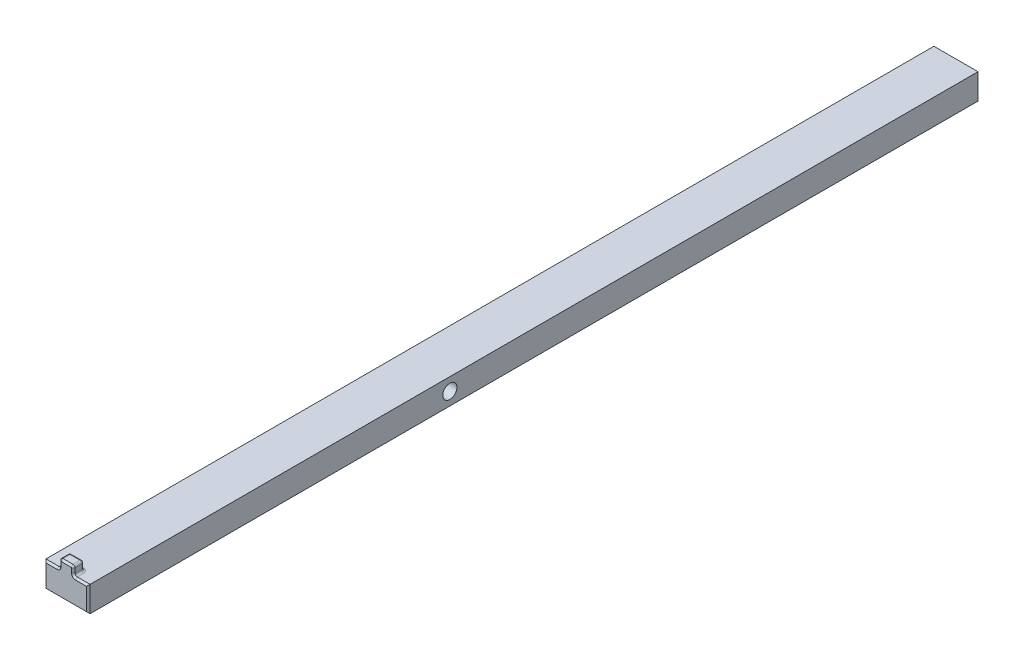
ISO-10303-21;
HEADER;
FILE_DESCRIPTION(('STEP AP214'),'2;1');
FILE_NAME('part.step','',(''),(''),'','','');
FILE_SCHEMA(('AUTOMOTIVE_DESIGN { 1 0 10303 214 1 1 1 1 }'));
ENDSEC;
DATA;
#1=APPLICATION_CONTEXT('core data for automotive mechanical design processes');
#2=APPLICATION_PROTOCOL_DEFINITION('international standard','automotive_design',2000,#1);
#3=PRODUCT_CONTEXT('',#1,'mechanical');
#4=PRODUCT('Part','Part','',(#3));
#5=PRODUCT_RELATED_PRODUCT_CATEGORY('part','',(#4));
#6=PRODUCT_DEFINITION_FORMATION('','',#4);
#7=PRODUCT_DEFINITION_CONTEXT('part definition',#1,'design');
#8=PRODUCT_DEFINITION('design','',#6,#7);
#9=PRODUCT_DEFINITION_SHAPE('','',#8);
#10=(LENGTH_UNIT() NAMED_UNIT(*) SI_UNIT(.MILLI.,.METRE.));
#11=(NAMED_UNIT(*) PLANE_ANGLE_UNIT() SI_UNIT($,.RADIAN.));
#12=(NAMED_UNIT(*) SI_UNIT($,.STERADIAN.) SOLID_ANGLE_UNIT());
#13=UNCERTAINTY_MEASURE_WITH_UNIT(LENGTH_MEASURE(1.E-05),#10,'distance_accuracy_value','');
#14=(GEOMETRIC_REPRESENTATION_CONTEXT(3) GLOBAL_UNCERTAINTY_ASSIGNED_CONTEXT((#13)) GLOBAL_UNIT_ASSIGNED_CONTEXT((#10,
#11,#12)) REPRESENTATION_CONTEXT('',''));
#15=CARTESIAN_POINT('',(0.,0.,0.));
#16=DIRECTION('',(0.,0.,1.));
#17=DIRECTION('',(1.,0.,0.));
#18=AXIS2_PLACEMENT_3D('',#15,#16,#17);
#19=CARTESIAN_POINT('',(6.23,-31.784,-37.8));
#20=DIRECTION('',(0.,-1.,0.));
#21=DIRECTION('',(0.,0.,-1.));
#22=AXIS2_PLACEMENT_3D('',#19,#20,#21);
#23=PLANE('',#22);
#24=DIRECTION('',(0.,0.,1.));
#25=VECTOR('',#24,1.);
#26=CARTESIAN_POINT('',(6.23,-31.784,-37.8));
#27=LINE('',#26,#25);
#28=CARTESIAN_POINT('',(6.23,-31.784,-289.3));
#29=VERTEX_POINT('',#28);
#30=CARTESIAN_POINT('',(6.23,-31.784,-38.3));
#31=VERTEX_POINT('',#30);
#32=EDGE_CURVE('E214',#29,#31,#27,.T.);
#33=ORIENTED_EDGE('',*,*,#32,.F.);
#34=DIRECTION('',(-1.,0.,0.));
#35=VECTOR('',#34,1.);
#36=CARTESIAN_POINT('',(6.23,-31.784,-289.3));
#37=LINE('',#36,#35);
#38=CARTESIAN_POINT('',(-6.23,-31.784,-289.3));
#39=VERTEX_POINT('',#38);
#40=EDGE_CURVE('E307',#29,#39,#37,.T.);
#41=ORIENTED_EDGE('',*,*,#40,.T.);
#42=DIRECTION('',(0.,0.,1.));
#43=VECTOR('',#42,1.);
#44=CARTESIAN_POINT('',(-6.23,-31.784,-37.8));
#45=LINE('',#44,#43);
#46=CARTESIAN_POINT('',(-6.23,-31.784,-38.3));
#47=VERTEX_POINT('',#46);
#48=EDGE_CURVE('E476',#39,#47,#45,.T.);
#49=ORIENTED_EDGE('',*,*,#48,.T.);
#50=DIRECTION('',(1.,0.,0.));
#51=VECTOR('',#50,1.);
#52=CARTESIAN_POINT('',(6.23,-31.784,-38.3));
#53=LINE('',#52,#51);
#54=CARTESIAN_POINT('',(-2.6,-31.784,-38.3));
#55=VERTEX_POINT('',#54);
#56=EDGE_CURVE('E304',#47,#55,#53,.T.);
#57=ORIENTED_EDGE('',*,*,#56,.T.);
#58=DIRECTION('',(0.,0.,1.));
#59=VECTOR('',#58,1.);
#60=CARTESIAN_POINT('',(-2.6,-31.784,-37.8));
#61=LINE('',#60,#59);
#62=CARTESIAN_POINT('',(-2.6,-31.784,-40.2));
#63=VERTEX_POINT('',#62);
#64=EDGE_CURVE('E232',#55,#63,#61,.F.);
#65=ORIENTED_EDGE('',*,*,#64,.T.);
#66=CARTESIAN_POINT('',(-1.4,-31.784,-40.2));
#67=DIRECTION('',(0.,-1.,0.));
#68=DIRECTION('',(0.,0.,-1.));
#69=AXIS2_PLACEMENT_3D('',#66,#67,#68);
#70=CIRCLE('',#69,1.2);
#71=CARTESIAN_POINT('',(-1.4,-31.784,-41.4));
#72=VERTEX_POINT('',#71);
#73=EDGE_CURVE('E229',#72,#63,#70,.F.);
#74=ORIENTED_EDGE('',*,*,#73,.F.);
#75=DIRECTION('',(1.,0.,0.));
#76=VECTOR('',#75,1.);
#77=CARTESIAN_POINT('',(2.,-31.784,-41.4));
#78=LINE('',#77,#76);
#79=CARTESIAN_POINT('',(1.4,-31.784,-41.4));
#80=VERTEX_POINT('',#79);
#81=EDGE_CURVE('E224',#72,#80,#78,.T.);
#82=ORIENTED_EDGE('',*,*,#81,.T.);
#83=CARTESIAN_POINT('',(1.4,-31.784,-40.2));
#84=DIRECTION('',(0.,-1.,0.));
#85=DIRECTION('',(0.,0.,-1.));
#86=AXIS2_PLACEMENT_3D('',#83,#84,#85);
#87=CIRCLE('',#86,1.2);
#88=CARTESIAN_POINT('',(2.6,-31.784,-40.2));
#89=VERTEX_POINT('',#88);
#90=EDGE_CURVE('E221',#89,#80,#87,.F.);
#91=ORIENTED_EDGE('',*,*,#90,.F.);
#92=DIRECTION('',(0.,0.,1.));
#93=VECTOR('',#92,1.);
#94=CARTESIAN_POINT('',(2.6,-31.784,-37.8));
#95=LINE('',#94,#93);
#96=CARTESIAN_POINT('',(2.6,-31.784,-38.3));
#97=VERTEX_POINT('',#96);
#98=EDGE_CURVE('E226',#89,#97,#95,.T.);
#99=ORIENTED_EDGE('',*,*,#98,.T.);
#100=DIRECTION('',(1.,0.,0.));
#101=VECTOR('',#100,1.);
#102=CARTESIAN_POINT('',(6.23,-31.784,-38.3));
#103=LINE('',#102,#101);
#104=EDGE_CURVE('E302',#97,#31,#103,.T.);
#105=ORIENTED_EDGE('',*,*,#104,.T.);
#106=EDGE_LOOP('',(#33,#41,#49,#57,#65,#74,#82,#91,#99,#105));
#107=FACE_BOUND('',#106,.T.);
#108=ADVANCED_FACE('F17',(#107),#23,.F.);
#109=CARTESIAN_POINT('',(6.23,0.,0.));
#110=DIRECTION('',(1.,0.,0.));
#111=DIRECTION('',(0.,0.,-1.));
#112=AXIS2_PLACEMENT_3D('',#109,#110,#111);
#113=PLANE('',#112);
#114=DIRECTION('',(0.,0.,-1.));
#115=VECTOR('',#114,1.);
#116=CARTESIAN_POINT('',(6.23,-38.984,-37.8));
#117=LINE('',#116,#115);
#118=CARTESIAN_POINT('',(6.23,-38.984,-38.3));
#119=VERTEX_POINT('',#118);
#120=CARTESIAN_POINT('',(6.23,-38.984,-289.3));
#121=VERTEX_POINT('',#120);
#122=EDGE_CURVE('E211',#119,#121,#117,.T.);
#123=ORIENTED_EDGE('',*,*,#122,.T.);
#124=DIRECTION('',(0.,1.,0.));
#125=VECTOR('',#124,1.);
#126=CARTESIAN_POINT('',(6.23,-31.784,-289.3));
#127=LINE('',#126,#125);
#128=EDGE_CURVE('E282',#121,#29,#127,.T.);
#129=ORIENTED_EDGE('',*,*,#128,.T.);
#130=ORIENTED_EDGE('',*,*,#32,.T.);
#131=DIRECTION('',(0.,-1.,0.));
#132=VECTOR('',#131,1.);
#133=CARTESIAN_POINT('',(6.23,-38.984,-38.3));
#134=LINE('',#133,#132);
#135=EDGE_CURVE('E254',#31,#119,#134,.T.);
#136=ORIENTED_EDGE('',*,*,#135,.T.);
#137=EDGE_LOOP('',(#123,#129,#130,#136));
#138=FACE_BOUND('',#137,.T.);
#139=CARTESIAN_POINT('',(6.23,-35.384,-140.));
#140=DIRECTION('',(1.,0.,0.));
#141=DIRECTION('',(0.,0.,-1.));
#142=AXIS2_PLACEMENT_3D('',#139,#140,#141);
#143=CIRCLE('',#142,2.);
#144=CARTESIAN_POINT('',(6.23,-35.384,-142.));
#145=VERTEX_POINT('',#144);
#146=EDGE_CURVE('E479',#145,#145,#143,.T.);
#147=ORIENTED_EDGE('',*,*,#146,.F.);
#148=EDGE_LOOP('',(#147));
#149=FACE_BOUND('',#148,.T.);
#150=ADVANCED_FACE('F455',(#138,#149),#113,.T.);
#151=CARTESIAN_POINT('',(-6.23,0.,0.));
#152=DIRECTION('',(1.,0.,0.));
#153=DIRECTION('',(0.,0.,-1.));
#154=AXIS2_PLACEMENT_3D('',#151,#152,#153);
#155=PLANE('',#154);
#156=ORIENTED_EDGE('',*,*,#48,.F.);
#157=DIRECTION('',(0.,-1.,0.));
#158=VECTOR('',#157,1.);
#159=CARTESIAN_POINT('',(-6.23,0.,-289.3));
#160=LINE('',#159,#158);
#161=CARTESIAN_POINT('',(-6.23,-38.984,-289.3));
#162=VERTEX_POINT('',#161);
#163=EDGE_CURVE('E300',#39,#162,#160,.T.);
#164=ORIENTED_EDGE('',*,*,#163,.T.);
#165=DIRECTION('',(0.,0.,-1.));
#166=VECTOR('',#165,1.);
#167=CARTESIAN_POINT('',(-6.23,-38.984,-37.8));
#168=LINE('',#167,#166);
#169=CARTESIAN_POINT('',(-6.23,-38.984,-38.3));
#170=VERTEX_POINT('',#169);
#171=EDGE_CURVE('E217',#170,#162,#168,.T.);
#172=ORIENTED_EDGE('',*,*,#171,.F.);
#173=DIRECTION('',(0.,1.,0.));
#174=VECTOR('',#173,1.);
#175=CARTESIAN_POINT('',(-6.23,0.,-38.3));
#176=LINE('',#175,#174);
#177=EDGE_CURVE('E298',#170,#47,#176,.T.);
#178=ORIENTED_EDGE('',*,*,#177,.T.);
#179=EDGE_LOOP('',(#156,#164,#172,#178));
#180=FACE_BOUND('',#179,.T.);
#181=CARTESIAN_POINT('',(-6.23,-35.384,-140.));
#182=DIRECTION('',(1.,0.,0.));
#183=DIRECTION('',(0.,0.,-1.));
#184=AXIS2_PLACEMENT_3D('',#181,#182,#183);
#185=CIRCLE('',#184,2.);
#186=CARTESIAN_POINT('',(-6.23,-35.384,-142.));
#187=VERTEX_POINT('',#186);
#188=EDGE_CURVE('E280',#187,#187,#185,.T.);
#189=ORIENTED_EDGE('',*,*,#188,.T.);
#190=EDGE_LOOP('',(#189));
#191=FACE_BOUND('',#190,.T.);
#192=ADVANCED_FACE('F487',(#180,#191),#155,.F.);
#193=CARTESIAN_POINT('',(6.23,-31.784,-289.8));
#194=DIRECTION('',(0.,0.,1.));
#195=DIRECTION('',(1.,0.,0.));
#196=AXIS2_PLACEMENT_3D('',#193,#194,#195);
#197=PLANE('',#196);
#198=DIRECTION('',(1.,0.,0.));
#199=VECTOR('',#198,1.);
#200=CARTESIAN_POINT('',(6.23,-32.284,-289.8));
#201=LINE('',#200,#199);
#202=CARTESIAN_POINT('',(-5.73,-32.284,-289.8));
#203=VERTEX_POINT('',#202);
#204=CARTESIAN_POINT('',(5.73,-32.284,-289.8));
#205=VERTEX_POINT('',#204);
#206=EDGE_CURVE('E285',#203,#205,#201,.T.);
#207=ORIENTED_EDGE('',*,*,#206,.T.);
#208=DIRECTION('',(0.,-1.,0.));
#209=VECTOR('',#208,1.);
#210=CARTESIAN_POINT('',(5.73,-38.984,-289.8));
#211=LINE('',#210,#209);
#212=CARTESIAN_POINT('',(5.73,-38.484,-289.8));
#213=VERTEX_POINT('',#212);
#214=EDGE_CURVE('E291',#205,#213,#211,.T.);
#215=ORIENTED_EDGE('',*,*,#214,.T.);
#216=DIRECTION('',(-1.,0.,0.));
#217=VECTOR('',#216,1.);
#218=CARTESIAN_POINT('',(6.23,-38.484,-289.8));
#219=LINE('',#218,#217);
#220=CARTESIAN_POINT('',(-5.73,-38.484,-289.8));
#221=VERTEX_POINT('',#220);
#222=EDGE_CURVE('E289',#213,#221,#219,.T.);
#223=ORIENTED_EDGE('',*,*,#222,.T.);
#224=DIRECTION('',(0.,1.,0.));
#225=VECTOR('',#224,1.);
#226=CARTESIAN_POINT('',(-5.73,-31.784,-289.8));
#227=LINE('',#226,#225);
#228=EDGE_CURVE('E287',#221,#203,#227,.T.);
#229=ORIENTED_EDGE('',*,*,#228,.T.);
#230=EDGE_LOOP('',(#207,#215,#223,#229));
#231=FACE_BOUND('',#230,.T.);
#232=ADVANCED_FACE('F507',(#231),#197,.F.);
#233=CARTESIAN_POINT('',(6.23,-31.784,-37.8));
#234=DIRECTION('',(0.,0.,-1.));
#235=DIRECTION('',(-1.,0.,0.));
#236=AXIS2_PLACEMENT_3D('',#233,#234,#235);
#237=PLANE('',#236);
#238=CARTESIAN_POINT('',(-2.6,-31.184,-37.8));
#239=DIRECTION('',(0.,0.,-1.));
#240=DIRECTION('',(-1.,0.,0.));
#241=AXIS2_PLACEMENT_3D('',#238,#239,#240);
#242=CIRCLE('',#241,1.1);
#243=CARTESIAN_POINT('',(-1.5,-31.184,-37.8));
#244=VERTEX_POINT('',#243);
#245=CARTESIAN_POINT('',(-2.6,-32.284,-37.8));
#246=VERTEX_POINT('',#245);
#247=EDGE_CURVE('E329',#244,#246,#242,.T.);
#248=ORIENTED_EDGE('',*,*,#247,.T.);
#249=DIRECTION('',(-1.,0.,0.));
#250=VECTOR('',#249,1.);
#251=CARTESIAN_POINT('',(6.23,-32.284,-37.8));
#252=LINE('',#251,#250);
#253=CARTESIAN_POINT('',(-5.73,-32.284,-37.8));
#254=VERTEX_POINT('',#253);
#255=EDGE_CURVE('E331',#246,#254,#252,.T.);
#256=ORIENTED_EDGE('',*,*,#255,.T.);
#257=DIRECTION('',(0.,-1.,0.));
#258=VECTOR('',#257,1.);
#259=CARTESIAN_POINT('',(-5.73,-31.784,-37.8));
#260=LINE('',#259,#258);
#261=CARTESIAN_POINT('',(-5.73,-38.484,-37.8));
#262=VERTEX_POINT('',#261);
#263=EDGE_CURVE('E313',#254,#262,#260,.T.);
#264=ORIENTED_EDGE('',*,*,#263,.T.);
#265=DIRECTION('',(1.,0.,0.));
#266=VECTOR('',#265,1.);
#267=CARTESIAN_POINT('',(6.23,-38.484,-37.8));
#268=LINE('',#267,#266);
#269=CARTESIAN_POINT('',(5.73,-38.484,-37.8));
#270=VERTEX_POINT('',#269);
#271=EDGE_CURVE('E311',#262,#270,#268,.T.);
#272=ORIENTED_EDGE('',*,*,#271,.T.);
#273=DIRECTION('',(0.,1.,0.));
#274=VECTOR('',#273,1.);
#275=CARTESIAN_POINT('',(5.73,-31.784,-37.8));
#276=LINE('',#275,#274);
#277=CARTESIAN_POINT('',(5.73,-32.284,-37.8));
#278=VERTEX_POINT('',#277);
#279=EDGE_CURVE('E309',#270,#278,#276,.T.);
#280=ORIENTED_EDGE('',*,*,#279,.T.);
#281=DIRECTION('',(-1.,0.,0.));
#282=VECTOR('',#281,1.);
#283=CARTESIAN_POINT('',(6.23,-32.284,-37.8));
#284=LINE('',#283,#282);
#285=CARTESIAN_POINT('',(2.6,-32.284,-37.8));
#286=VERTEX_POINT('',#285);
#287=EDGE_CURVE('E315',#278,#286,#284,.T.);
#288=ORIENTED_EDGE('',*,*,#287,.T.);
#289=CARTESIAN_POINT('',(2.6,-31.184,-37.8));
#290=DIRECTION('',(0.,0.,-1.));
#291=DIRECTION('',(-1.,0.,0.));
#292=AXIS2_PLACEMENT_3D('',#289,#290,#291);
#293=CIRCLE('',#292,1.1);
#294=CARTESIAN_POINT('',(1.5,-31.184,-37.8));
#295=VERTEX_POINT('',#294);
#296=EDGE_CURVE('E317',#286,#295,#293,.T.);
#297=ORIENTED_EDGE('',*,*,#296,.T.);
#298=DIRECTION('',(0.,1.,0.));
#299=VECTOR('',#298,1.);
#300=CARTESIAN_POINT('',(1.5,-29.884,-37.8));
#301=LINE('',#300,#299);
#302=CARTESIAN_POINT('',(1.5,-29.884,-37.8));
#303=VERTEX_POINT('',#302);
#304=EDGE_CURVE('E319',#295,#303,#301,.T.);
#305=ORIENTED_EDGE('',*,*,#304,.T.);
#306=CARTESIAN_POINT('',(1.4,-29.884,-37.8));
#307=DIRECTION('',(0.,0.,-1.));
#308=DIRECTION('',(-1.,0.,0.));
#309=AXIS2_PLACEMENT_3D('',#306,#307,#308);
#310=CIRCLE('',#309,0.1);
#311=CARTESIAN_POINT('',(1.4,-29.784,-37.8));
#312=VERTEX_POINT('',#311);
#313=EDGE_CURVE('E321',#303,#312,#310,.F.);
#314=ORIENTED_EDGE('',*,*,#313,.T.);
#315=DIRECTION('',(-1.,0.,0.));
#316=VECTOR('',#315,1.);
#317=CARTESIAN_POINT('',(-1.4,-29.784,-37.8));
#318=LINE('',#317,#316);
#319=CARTESIAN_POINT('',(-1.4,-29.784,-37.8));
#320=VERTEX_POINT('',#319);
#321=EDGE_CURVE('E323',#312,#320,#318,.T.);
#322=ORIENTED_EDGE('',*,*,#321,.T.);
#323=CARTESIAN_POINT('',(-1.4,-29.884,-37.8));
#324=DIRECTION('',(0.,0.,-1.));
#325=DIRECTION('',(-1.,0.,0.));
#326=AXIS2_PLACEMENT_3D('',#323,#324,#325);
#327=CIRCLE('',#326,0.1);
#328=CARTESIAN_POINT('',(-1.5,-29.884,-37.8));
#329=VERTEX_POINT('',#328);
#330=EDGE_CURVE('E325',#320,#329,#327,.F.);
#331=ORIENTED_EDGE('',*,*,#330,.T.);
#332=DIRECTION('',(0.,-1.,0.));
#333=VECTOR('',#332,1.);
#334=CARTESIAN_POINT('',(-1.5,-31.184,-37.8));
#335=LINE('',#334,#333);
#336=EDGE_CURVE('E327',#329,#244,#335,.T.);
#337=ORIENTED_EDGE('',*,*,#336,.T.);
#338=EDGE_LOOP('',(#248,#256,#264,#272,#280,#288,#297,#305,#314,#322,#331,#337));
#339=FACE_BOUND('',#338,.T.);
#340=ADVANCED_FACE('F441',(#339),#237,.F.);
#341=CARTESIAN_POINT('',(6.23,-38.984,-37.8));
#342=DIRECTION('',(0.,1.,0.));
#343=DIRECTION('',(0.,0.,1.));
#344=AXIS2_PLACEMENT_3D('',#341,#342,#343);
#345=PLANE('',#344);
#346=ORIENTED_EDGE('',*,*,#171,.T.);
#347=DIRECTION('',(1.,0.,0.));
#348=VECTOR('',#347,1.);
#349=CARTESIAN_POINT('',(6.23,-38.984,-289.3));
#350=LINE('',#349,#348);
#351=EDGE_CURVE('E296',#162,#121,#350,.T.);
#352=ORIENTED_EDGE('',*,*,#351,.T.);
#353=ORIENTED_EDGE('',*,*,#122,.F.);
#354=DIRECTION('',(-1.,0.,0.));
#355=VECTOR('',#354,1.);
#356=CARTESIAN_POINT('',(6.23,-38.984,-38.3));
#357=LINE('',#356,#355);
#358=EDGE_CURVE('E294',#119,#170,#357,.T.);
#359=ORIENTED_EDGE('',*,*,#358,.T.);
#360=EDGE_LOOP('',(#346,#352,#353,#359));
#361=FACE_BOUND('',#360,.T.);
#362=ADVANCED_FACE('F460',(#361),#345,.F.);
#363=CARTESIAN_POINT('',(6.23,-35.384,-140.));
#364=DIRECTION('',(-1.,0.,0.));
#365=DIRECTION('',(0.,0.,1.));
#366=AXIS2_PLACEMENT_3D('',#363,#364,#365);
#367=CYLINDRICAL_SURFACE('',#366,2.);
#368=ORIENTED_EDGE('',*,*,#146,.T.);
#369=EDGE_LOOP('',(#368));
#370=FACE_BOUND('',#369,.T.);
#371=ORIENTED_EDGE('',*,*,#188,.F.);
#372=EDGE_LOOP('',(#371));
#373=FACE_BOUND('',#372,.T.);
#374=ADVANCED_FACE('F489',(#370,#373),#367,.F.);
#375=CARTESIAN_POINT('',(-2.,-29.284,-40.8));
#376=DIRECTION('',(-1.,0.,0.));
#377=DIRECTION('',(0.,-1.,0.));
#378=AXIS2_PLACEMENT_3D('',#375,#376,#377);
#379=PLANE('',#378);
#380=DIRECTION('',(0.,0.,1.));
#381=VECTOR('',#380,1.);
#382=CARTESIAN_POINT('',(-2.,-31.184,-40.8));
#383=LINE('',#382,#381);
#384=CARTESIAN_POINT('',(-2.,-31.184,-40.2));
#385=VERTEX_POINT('',#384);
#386=CARTESIAN_POINT('',(-2.,-31.184,-38.3));
#387=VERTEX_POINT('',#386);
#388=EDGE_CURVE('E185',#385,#387,#383,.T.);
#389=ORIENTED_EDGE('',*,*,#388,.T.);
#390=DIRECTION('',(0.,1.,0.));
#391=VECTOR('',#390,1.);
#392=CARTESIAN_POINT('',(-2.,-29.884,-38.3));
#393=LINE('',#392,#391);
#394=CARTESIAN_POINT('',(-2.,-29.884,-38.3));
#395=VERTEX_POINT('',#394);
#396=EDGE_CURVE('E182',#387,#395,#393,.T.);
#397=ORIENTED_EDGE('',*,*,#396,.T.);
#398=DIRECTION('',(0.,0.,1.));
#399=VECTOR('',#398,1.);
#400=CARTESIAN_POINT('',(-2.,-29.884,-40.8));
#401=LINE('',#400,#399);
#402=CARTESIAN_POINT('',(-2.,-29.884,-40.2));
#403=VERTEX_POINT('',#402);
#404=EDGE_CURVE('E174',#395,#403,#401,.F.);
#405=ORIENTED_EDGE('',*,*,#404,.T.);
#406=DIRECTION('',(0.,-1.,0.));
#407=VECTOR('',#406,1.);
#408=CARTESIAN_POINT('',(-2.,-31.784,-40.2));
#409=LINE('',#408,#407);
#410=EDGE_CURVE('E179',#403,#385,#409,.T.);
#411=ORIENTED_EDGE('',*,*,#410,.T.);
#412=EDGE_LOOP('',(#389,#397,#405,#411));
#413=FACE_BOUND('',#412,.T.);
#414=ADVANCED_FACE('F177',(#413),#379,.T.);
#415=CARTESIAN_POINT('',(2.,-29.284,-40.8));
#416=DIRECTION('',(0.,1.,0.));
#417=DIRECTION('',(0.,0.,1.));
#418=AXIS2_PLACEMENT_3D('',#415,#416,#417);
#419=PLANE('',#418);
#420=DIRECTION('',(0.,0.,1.));
#421=VECTOR('',#420,1.);
#422=CARTESIAN_POINT('',(-1.4,-29.284,-40.8));
#423=LINE('',#422,#421);
#424=CARTESIAN_POINT('',(-1.4,-29.284,-40.2));
#425=VERTEX_POINT('',#424);
#426=CARTESIAN_POINT('',(-1.4,-29.284,-38.3));
#427=VERTEX_POINT('',#426);
#428=EDGE_CURVE('E193',#425,#427,#423,.T.);
#429=ORIENTED_EDGE('',*,*,#428,.T.);
#430=DIRECTION('',(1.,0.,0.));
#431=VECTOR('',#430,1.);
#432=CARTESIAN_POINT('',(1.4,-29.284,-38.3));
#433=LINE('',#432,#431);
#434=CARTESIAN_POINT('',(1.4,-29.284,-38.3));
#435=VERTEX_POINT('',#434);
#436=EDGE_CURVE('E339',#427,#435,#433,.T.);
#437=ORIENTED_EDGE('',*,*,#436,.T.);
#438=DIRECTION('',(0.,0.,1.));
#439=VECTOR('',#438,1.);
#440=CARTESIAN_POINT('',(1.4,-29.284,-40.8));
#441=LINE('',#440,#439);
#442=CARTESIAN_POINT('',(1.4,-29.284,-40.2));
#443=VERTEX_POINT('',#442);
#444=EDGE_CURVE('E242',#435,#443,#441,.F.);
#445=ORIENTED_EDGE('',*,*,#444,.T.);
#446=DIRECTION('',(-1.,0.,0.));
#447=VECTOR('',#446,1.);
#448=CARTESIAN_POINT('',(-2.,-29.284,-40.2));
#449=LINE('',#448,#447);
#450=EDGE_CURVE('E240',#443,#425,#449,.T.);
#451=ORIENTED_EDGE('',*,*,#450,.T.);
#452=EDGE_LOOP('',(#429,#437,#445,#451));
#453=FACE_BOUND('',#452,.T.);
#454=ADVANCED_FACE('F429',(#453),#419,.T.);
#455=CARTESIAN_POINT('',(2.,-31.784,-40.8));
#456=DIRECTION('',(1.,0.,0.));
#457=DIRECTION('',(0.,1.,0.));
#458=AXIS2_PLACEMENT_3D('',#455,#456,#457);
#459=PLANE('',#458);
#460=DIRECTION('',(0.,0.,1.));
#461=VECTOR('',#460,1.);
#462=CARTESIAN_POINT('',(2.,-29.884,-40.8));
#463=LINE('',#462,#461);
#464=CARTESIAN_POINT('',(2.,-29.884,-40.2));
#465=VERTEX_POINT('',#464);
#466=CARTESIAN_POINT('',(2.,-29.884,-38.3));
#467=VERTEX_POINT('',#466);
#468=EDGE_CURVE('E236',#465,#467,#463,.T.);
#469=ORIENTED_EDGE('',*,*,#468,.T.);
#470=DIRECTION('',(0.,-1.,0.));
#471=VECTOR('',#470,1.);
#472=CARTESIAN_POINT('',(2.,-31.184,-38.3));
#473=LINE('',#472,#471);
#474=CARTESIAN_POINT('',(2.,-31.184,-38.3));
#475=VERTEX_POINT('',#474);
#476=EDGE_CURVE('E27',#467,#475,#473,.T.);
#477=ORIENTED_EDGE('',*,*,#476,.T.);
#478=DIRECTION('',(0.,0.,1.));
#479=VECTOR('',#478,1.);
#480=CARTESIAN_POINT('',(2.,-31.184,-40.8));
#481=LINE('',#480,#479);
#482=CARTESIAN_POINT('',(2.,-31.184,-40.2));
#483=VERTEX_POINT('',#482);
#484=EDGE_CURVE('E238',#475,#483,#481,.F.);
#485=ORIENTED_EDGE('',*,*,#484,.T.);
#486=DIRECTION('',(0.,1.,0.));
#487=VECTOR('',#486,1.);
#488=CARTESIAN_POINT('',(2.,-29.284,-40.2));
#489=LINE('',#488,#487);
#490=EDGE_CURVE('E234',#483,#465,#489,.T.);
#491=ORIENTED_EDGE('',*,*,#490,.T.);
#492=EDGE_LOOP('',(#469,#477,#485,#491));
#493=FACE_BOUND('',#492,.T.);
#494=ADVANCED_FACE('F419',(#493),#459,.T.);
#495=CARTESIAN_POINT('',(0.,0.,-40.8));
#496=DIRECTION('',(0.,0.,1.));
#497=DIRECTION('',(1.,0.,0.));
#498=AXIS2_PLACEMENT_3D('',#495,#496,#497);
#499=PLANE('',#498);
#500=DIRECTION('',(1.,0.,0.));
#501=VECTOR('',#500,1.);
#502=CARTESIAN_POINT('',(-2.,-31.184,-40.8));
#503=LINE('',#502,#501);
#504=CARTESIAN_POINT('',(1.4,-31.184,-40.8));
#505=VERTEX_POINT('',#504);
#506=CARTESIAN_POINT('',(-1.4,-31.184,-40.8));
#507=VERTEX_POINT('',#506);
#508=EDGE_CURVE('E247',#505,#507,#503,.F.);
#509=ORIENTED_EDGE('',*,*,#508,.T.);
#510=DIRECTION('',(0.,-1.,0.));
#511=VECTOR('',#510,1.);
#512=CARTESIAN_POINT('',(-1.4,-29.284,-40.8));
#513=LINE('',#512,#511);
#514=CARTESIAN_POINT('',(-1.4,-29.884,-40.8));
#515=VERTEX_POINT('',#514);
#516=EDGE_CURVE('E252',#507,#515,#513,.F.);
#517=ORIENTED_EDGE('',*,*,#516,.T.);
#518=DIRECTION('',(-1.,0.,0.));
#519=VECTOR('',#518,1.);
#520=CARTESIAN_POINT('',(2.,-29.884,-40.8));
#521=LINE('',#520,#519);
#522=CARTESIAN_POINT('',(1.4,-29.884,-40.8));
#523=VERTEX_POINT('',#522);
#524=EDGE_CURVE('E249',#515,#523,#521,.F.);
#525=ORIENTED_EDGE('',*,*,#524,.T.);
#526=DIRECTION('',(0.,1.,0.));
#527=VECTOR('',#526,1.);
#528=CARTESIAN_POINT('',(1.4,-31.784,-40.8));
#529=LINE('',#528,#527);
#530=EDGE_CURVE('E245',#523,#505,#529,.F.);
#531=ORIENTED_EDGE('',*,*,#530,.T.);
#532=EDGE_LOOP('',(#509,#517,#525,#531));
#533=FACE_BOUND('',#532,.T.);
#534=ADVANCED_FACE('F412',(#533),#499,.F.);
#535=CARTESIAN_POINT('',(1.4,-29.884,-40.8));
#536=DIRECTION('',(0.,0.,1.));
#537=DIRECTION('',(1.,0.,0.));
#538=AXIS2_PLACEMENT_3D('',#535,#536,#537);
#539=CYLINDRICAL_SURFACE('',#538,0.6);
#540=ORIENTED_EDGE('',*,*,#444,.F.);
#541=CARTESIAN_POINT('',(1.4,-29.884,-38.3));
#542=DIRECTION('',(0.,0.,-1.));
#543=DIRECTION('',(-1.,0.,0.));
#544=AXIS2_PLACEMENT_3D('',#541,#542,#543);
#545=CIRCLE('',#544,0.6);
#546=EDGE_CURVE('E42',#435,#467,#545,.T.);
#547=ORIENTED_EDGE('',*,*,#546,.T.);
#548=ORIENTED_EDGE('',*,*,#468,.F.);
#549=CARTESIAN_POINT('',(1.4,-29.884,-40.2));
#550=DIRECTION('',(0.,0.,-1.));
#551=DIRECTION('',(-1.,0.,0.));
#552=AXIS2_PLACEMENT_3D('',#549,#550,#551);
#553=CIRCLE('',#552,0.6);
#554=EDGE_CURVE('E277',#443,#465,#553,.T.);
#555=ORIENTED_EDGE('',*,*,#554,.F.);
#556=EDGE_LOOP('',(#540,#547,#548,#555));
#557=FACE_BOUND('',#556,.T.);
#558=ADVANCED_FACE('F421',(#557),#539,.T.);
#559=CARTESIAN_POINT('',(1.4,-29.884,-40.2));
#560=DIRECTION('',(1.,0.,0.));
#561=DIRECTION('',(0.,0.,-1.));
#562=AXIS2_PLACEMENT_3D('',#559,#560,#561);
#563=SPHERICAL_SURFACE('',#562,0.6);
#564=CARTESIAN_POINT('',(1.4,-29.884,-40.2));
#565=DIRECTION('',(1.,0.,0.));
#566=DIRECTION('',(0.,0.,-1.));
#567=AXIS2_PLACEMENT_3D('',#564,#565,#566);
#568=CIRCLE('',#567,0.6);
#569=EDGE_CURVE('E271',#443,#523,#568,.F.);
#570=ORIENTED_EDGE('',*,*,#569,.F.);
#571=ORIENTED_EDGE('',*,*,#554,.T.);
#572=CARTESIAN_POINT('',(1.4,-29.884,-40.2));
#573=DIRECTION('',(0.,1.,0.));
#574=DIRECTION('',(0.,0.,1.));
#575=AXIS2_PLACEMENT_3D('',#572,#573,#574);
#576=CIRCLE('',#575,0.6);
#577=EDGE_CURVE('E274',#523,#465,#576,.F.);
#578=ORIENTED_EDGE('',*,*,#577,.F.);
#579=EDGE_LOOP('',(#570,#571,#578));
#580=FACE_BOUND('',#579,.T.);
#581=ADVANCED_FACE('F424',(#580),#563,.T.);
#582=CARTESIAN_POINT('',(2.6,-31.184,-37.8));
#583=DIRECTION('',(0.,0.,1.));
#584=DIRECTION('',(1.,0.,0.));
#585=AXIS2_PLACEMENT_3D('',#582,#583,#584);
#586=CYLINDRICAL_SURFACE('',#585,0.6);
#587=ORIENTED_EDGE('',*,*,#484,.F.);
#588=CARTESIAN_POINT('',(2.6,-31.184,-38.3));
#589=DIRECTION('',(0.,0.,-1.));
#590=DIRECTION('',(-1.,0.,0.));
#591=AXIS2_PLACEMENT_3D('',#588,#589,#590);
#592=CIRCLE('',#591,0.6);
#593=EDGE_CURVE('E11',#475,#97,#592,.F.);
#594=ORIENTED_EDGE('',*,*,#593,.T.);
#595=ORIENTED_EDGE('',*,*,#98,.F.);
#596=CARTESIAN_POINT('',(2.6,-31.184,-40.2));
#597=DIRECTION('',(0.,0.,1.));
#598=DIRECTION('',(1.,0.,0.));
#599=AXIS2_PLACEMENT_3D('',#596,#597,#598);
#600=CIRCLE('',#599,0.6);
#601=EDGE_CURVE('E268',#483,#89,#600,.T.);
#602=ORIENTED_EDGE('',*,*,#601,.F.);
#603=EDGE_LOOP('',(#587,#594,#595,#602));
#604=FACE_BOUND('',#603,.T.);
#605=ADVANCED_FACE('F398',(#604),#586,.F.);
#606=CARTESIAN_POINT('',(1.4,-31.784,-40.2));
#607=DIRECTION('',(0.,-1.,0.));
#608=DIRECTION('',(1.,0.,0.));
#609=AXIS2_PLACEMENT_3D('',#606,#607,#608);
#610=CYLINDRICAL_SURFACE('',#609,0.6);
#611=ORIENTED_EDGE('',*,*,#577,.T.);
#612=ORIENTED_EDGE('',*,*,#490,.F.);
#613=CARTESIAN_POINT('',(1.4,-31.184,-40.2));
#614=DIRECTION('',(0.,-1.,0.));
#615=DIRECTION('',(0.,0.,-1.));
#616=AXIS2_PLACEMENT_3D('',#613,#614,#615);
#617=CIRCLE('',#616,0.6);
#618=EDGE_CURVE('E265',#505,#483,#617,.T.);
#619=ORIENTED_EDGE('',*,*,#618,.F.);
#620=ORIENTED_EDGE('',*,*,#530,.F.);
#621=EDGE_LOOP('',(#611,#612,#619,#620));
#622=FACE_BOUND('',#621,.T.);
#623=ADVANCED_FACE('F418',(#622),#610,.T.);
#624=CARTESIAN_POINT('',(2.,-29.884,-40.2));
#625=DIRECTION('',(1.,0.,0.));
#626=DIRECTION('',(0.,0.,-1.));
#627=AXIS2_PLACEMENT_3D('',#624,#625,#626);
#628=CYLINDRICAL_SURFACE('',#627,0.6);
#629=ORIENTED_EDGE('',*,*,#569,.T.);
#630=ORIENTED_EDGE('',*,*,#524,.F.);
#631=CARTESIAN_POINT('',(-1.4,-29.884,-40.2));
#632=DIRECTION('',(-1.,0.,0.));
#633=DIRECTION('',(0.,0.,1.));
#634=AXIS2_PLACEMENT_3D('',#631,#632,#633);
#635=CIRCLE('',#634,0.6);
#636=EDGE_CURVE('E197',#425,#515,#635,.T.);
#637=ORIENTED_EDGE('',*,*,#636,.F.);
#638=ORIENTED_EDGE('',*,*,#450,.F.);
#639=EDGE_LOOP('',(#629,#630,#637,#638));
#640=FACE_BOUND('',#639,.T.);
#641=ADVANCED_FACE('F427',(#640),#628,.T.);
#642=CARTESIAN_POINT('',(-1.4,-29.884,-40.8));
#643=DIRECTION('',(0.,0.,1.));
#644=DIRECTION('',(1.,0.,0.));
#645=AXIS2_PLACEMENT_3D('',#642,#643,#644);
#646=CYLINDRICAL_SURFACE('',#645,0.6);
#647=ORIENTED_EDGE('',*,*,#404,.F.);
#648=CARTESIAN_POINT('',(-1.4,-29.884,-38.3));
#649=DIRECTION('',(0.,0.,-1.));
#650=DIRECTION('',(-1.,0.,0.));
#651=AXIS2_PLACEMENT_3D('',#648,#649,#650);
#652=CIRCLE('',#651,0.6);
#653=EDGE_CURVE('E337',#395,#427,#652,.T.);
#654=ORIENTED_EDGE('',*,*,#653,.T.);
#655=ORIENTED_EDGE('',*,*,#428,.F.);
#656=CARTESIAN_POINT('',(-1.4,-29.884,-40.2));
#657=DIRECTION('',(0.,0.,-1.));
#658=DIRECTION('',(-1.,0.,0.));
#659=AXIS2_PLACEMENT_3D('',#656,#657,#658);
#660=CIRCLE('',#659,0.6);
#661=EDGE_CURVE('E189',#403,#425,#660,.T.);
#662=ORIENTED_EDGE('',*,*,#661,.F.);
#663=EDGE_LOOP('',(#647,#654,#655,#662));
#664=FACE_BOUND('',#663,.T.);
#665=ADVANCED_FACE('F191',(#664),#646,.T.);
#666=CARTESIAN_POINT('',(1.4,-31.184,-40.2));
#667=DIRECTION('',(0.,-1.,0.));
#668=DIRECTION('',(0.,0.,-1.));
#669=AXIS2_PLACEMENT_3D('',#666,#667,#668);
#670=TOROIDAL_SURFACE('',#669,1.2,0.6);
#671=ORIENTED_EDGE('',*,*,#601,.T.);
#672=ORIENTED_EDGE('',*,*,#90,.T.);
#673=CARTESIAN_POINT('',(1.4,-31.184,-41.4));
#674=DIRECTION('',(-1.,0.,0.));
#675=DIRECTION('',(0.,0.,1.));
#676=AXIS2_PLACEMENT_3D('',#673,#674,#675);
#677=CIRCLE('',#676,0.6);
#678=EDGE_CURVE('E198',#505,#80,#677,.F.);
#679=ORIENTED_EDGE('',*,*,#678,.F.);
#680=ORIENTED_EDGE('',*,*,#618,.T.);
#681=EDGE_LOOP('',(#671,#672,#679,#680));
#682=FACE_BOUND('',#681,.T.);
#683=ADVANCED_FACE('F406',(#682),#670,.F.);
#684=CARTESIAN_POINT('',(-1.4,-29.884,-40.2));
#685=DIRECTION('',(0.,1.,0.));
#686=DIRECTION('',(0.,0.,1.));
#687=AXIS2_PLACEMENT_3D('',#684,#685,#686);
#688=SPHERICAL_SURFACE('',#687,0.6);
#689=ORIENTED_EDGE('',*,*,#661,.T.);
#690=ORIENTED_EDGE('',*,*,#636,.T.);
#691=CARTESIAN_POINT('',(-1.4,-29.884,-40.2));
#692=DIRECTION('',(0.,1.,0.));
#693=DIRECTION('',(0.,0.,1.));
#694=AXIS2_PLACEMENT_3D('',#691,#692,#693);
#695=CIRCLE('',#694,0.6);
#696=EDGE_CURVE('E201',#403,#515,#695,.F.);
#697=ORIENTED_EDGE('',*,*,#696,.F.);
#698=EDGE_LOOP('',(#689,#690,#697));
#699=FACE_BOUND('',#698,.T.);
#700=ADVANCED_FACE('F202',(#699),#688,.T.);
#701=CARTESIAN_POINT('',(6.23,-31.184,-41.4));
#702=DIRECTION('',(-1.,0.,0.));
#703=DIRECTION('',(0.,0.,1.));
#704=AXIS2_PLACEMENT_3D('',#701,#702,#703);
#705=CYLINDRICAL_SURFACE('',#704,0.6);
#706=ORIENTED_EDGE('',*,*,#678,.T.);
#707=ORIENTED_EDGE('',*,*,#81,.F.);
#708=CARTESIAN_POINT('',(-1.4,-31.184,-41.4));
#709=DIRECTION('',(1.,0.,0.));
#710=DIRECTION('',(0.,0.,-1.));
#711=AXIS2_PLACEMENT_3D('',#708,#709,#710);
#712=CIRCLE('',#711,0.6);
#713=EDGE_CURVE('E205',#507,#72,#712,.T.);
#714=ORIENTED_EDGE('',*,*,#713,.F.);
#715=ORIENTED_EDGE('',*,*,#508,.F.);
#716=EDGE_LOOP('',(#706,#707,#714,#715));
#717=FACE_BOUND('',#716,.T.);
#718=ADVANCED_FACE('F409',(#717),#705,.F.);
#719=CARTESIAN_POINT('',(-1.4,-29.284,-40.2));
#720=DIRECTION('',(0.,1.,0.));
#721=DIRECTION('',(-1.,0.,0.));
#722=AXIS2_PLACEMENT_3D('',#719,#720,#721);
#723=CYLINDRICAL_SURFACE('',#722,0.6);
#724=ORIENTED_EDGE('',*,*,#696,.T.);
#725=ORIENTED_EDGE('',*,*,#516,.F.);
#726=CARTESIAN_POINT('',(-1.4,-31.184,-40.2));
#727=DIRECTION('',(0.,-1.,0.));
#728=DIRECTION('',(0.,0.,-1.));
#729=AXIS2_PLACEMENT_3D('',#726,#727,#728);
#730=CIRCLE('',#729,0.6);
#731=EDGE_CURVE('E209',#385,#507,#730,.T.);
#732=ORIENTED_EDGE('',*,*,#731,.F.);
#733=ORIENTED_EDGE('',*,*,#410,.F.);
#734=EDGE_LOOP('',(#724,#725,#732,#733));
#735=FACE_BOUND('',#734,.T.);
#736=ADVANCED_FACE('F207',(#735),#723,.T.);
#737=CARTESIAN_POINT('',(-1.4,-31.184,-40.2));
#738=DIRECTION('',(0.,-1.,0.));
#739=DIRECTION('',(0.,0.,-1.));
#740=AXIS2_PLACEMENT_3D('',#737,#738,#739);
#741=TOROIDAL_SURFACE('',#740,1.2,0.6);
#742=ORIENTED_EDGE('',*,*,#713,.T.);
#743=ORIENTED_EDGE('',*,*,#73,.T.);
#744=CARTESIAN_POINT('',(-2.6,-31.184,-40.2));
#745=DIRECTION('',(0.,0.,1.));
#746=DIRECTION('',(1.,0.,0.));
#747=AXIS2_PLACEMENT_3D('',#744,#745,#746);
#748=CIRCLE('',#747,0.6);
#749=EDGE_CURVE('E255',#385,#63,#748,.F.);
#750=ORIENTED_EDGE('',*,*,#749,.F.);
#751=ORIENTED_EDGE('',*,*,#731,.T.);
#752=EDGE_LOOP('',(#742,#743,#750,#751));
#753=FACE_BOUND('',#752,.T.);
#754=ADVANCED_FACE('F515',(#753),#741,.F.);
#755=CARTESIAN_POINT('',(-2.6,-31.184,-40.8));
#756=DIRECTION('',(0.,0.,1.));
#757=DIRECTION('',(1.,0.,0.));
#758=AXIS2_PLACEMENT_3D('',#755,#756,#757);
#759=CYLINDRICAL_SURFACE('',#758,0.6);
#760=ORIENTED_EDGE('',*,*,#64,.F.);
#761=CARTESIAN_POINT('',(-2.6,-31.184,-38.3));
#762=DIRECTION('',(0.,0.,-1.));
#763=DIRECTION('',(-1.,0.,0.));
#764=AXIS2_PLACEMENT_3D('',#761,#762,#763);
#765=CIRCLE('',#764,0.6);
#766=EDGE_CURVE('E334',#55,#387,#765,.F.);
#767=ORIENTED_EDGE('',*,*,#766,.T.);
#768=ORIENTED_EDGE('',*,*,#388,.F.);
#769=ORIENTED_EDGE('',*,*,#749,.T.);
#770=EDGE_LOOP('',(#760,#767,#768,#769));
#771=FACE_BOUND('',#770,.T.);
#772=ADVANCED_FACE('F511',(#771),#759,.F.);
#773=CARTESIAN_POINT('',(-5.73,-31.784,-289.8));
#774=DIRECTION('',(0.707106781186548,0.,0.707106781186548));
#775=DIRECTION('',(0.,1.,0.));
#776=AXIS2_PLACEMENT_3D('',#773,#774,#775);
#777=PLANE('',#776);
#778=DIRECTION('',(-0.577350269189604,0.577350269189669,0.577350269189604));
#779=VECTOR('',#778,1.);
#780=CARTESIAN_POINT('',(-2.07666666666693,-35.9373333333334,-293.453333333333));
#781=LINE('',#780,#779);
#782=EDGE_CURVE('E347',#203,#39,#781,.T.);
#783=ORIENTED_EDGE('',*,*,#782,.F.);
#784=ORIENTED_EDGE('',*,*,#228,.F.);
#785=DIRECTION('',(-0.577350269189604,-0.577350269189669,0.577350269189604));
#786=VECTOR('',#785,1.);
#787=CARTESIAN_POINT('',(-3.49666666666658,-36.2506666666664,-292.033333333334));
#788=LINE('',#787,#786);
#789=EDGE_CURVE('E258',#162,#221,#788,.F.);
#790=ORIENTED_EDGE('',*,*,#789,.F.);
#791=ORIENTED_EDGE('',*,*,#163,.F.);
#792=EDGE_LOOP('',(#783,#784,#790,#791));
#793=FACE_BOUND('',#792,.T.);
#794=ADVANCED_FACE('F514',(#793),#777,.F.);
#795=CARTESIAN_POINT('',(6.23,-38.484,-289.8));
#796=DIRECTION('',(0.,0.707106781186508,0.707106781186587));
#797=DIRECTION('',(-1.,0.,0.));
#798=AXIS2_PLACEMENT_3D('',#795,#796,#797);
#799=PLANE('',#798);
#800=ORIENTED_EDGE('',*,*,#789,.T.);
#801=ORIENTED_EDGE('',*,*,#222,.F.);
#802=DIRECTION('',(-0.577350269189604,0.577350269189669,-0.577350269189604));
#803=VECTOR('',#802,1.);
#804=CARTESIAN_POINT('',(5.89666666666665,-38.6506666666667,-289.633333333333));
#805=LINE('',#804,#803);
#806=EDGE_CURVE('E345',#121,#213,#805,.T.);
#807=ORIENTED_EDGE('',*,*,#806,.F.);
#808=ORIENTED_EDGE('',*,*,#351,.F.);
#809=EDGE_LOOP('',(#800,#801,#807,#808));
#810=FACE_BOUND('',#809,.T.);
#811=ADVANCED_FACE('F465',(#810),#799,.F.);
#812=CARTESIAN_POINT('',(6.23,-31.784,-289.3));
#813=DIRECTION('',(0.,-0.707106781186508,0.707106781186587));
#814=DIRECTION('',(-1.,0.,0.));
#815=AXIS2_PLACEMENT_3D('',#812,#813,#814);
#816=PLANE('',#815);
#817=ORIENTED_EDGE('',*,*,#782,.T.);
#818=ORIENTED_EDGE('',*,*,#40,.F.);
#819=DIRECTION('',(0.577350269189604,0.577350269189669,0.577350269189604));
#820=VECTOR('',#819,1.);
#821=CARTESIAN_POINT('',(6.23,-31.784,-289.3));
#822=LINE('',#821,#820);
#823=EDGE_CURVE('E343',#205,#29,#822,.T.);
#824=ORIENTED_EDGE('',*,*,#823,.F.);
#825=ORIENTED_EDGE('',*,*,#206,.F.);
#826=EDGE_LOOP('',(#817,#818,#824,#825));
#827=FACE_BOUND('',#826,.T.);
#828=ADVANCED_FACE('F547',(#827),#816,.F.);
#829=CARTESIAN_POINT('',(6.23,0.,-289.3));
#830=DIRECTION('',(0.707106781186548,0.,-0.707106781186548));
#831=DIRECTION('',(0.,-1.,0.));
#832=AXIS2_PLACEMENT_3D('',#829,#830,#831);
#833=PLANE('',#832);
#834=ORIENTED_EDGE('',*,*,#806,.T.);
#835=ORIENTED_EDGE('',*,*,#214,.F.);
#836=ORIENTED_EDGE('',*,*,#823,.T.);
#837=ORIENTED_EDGE('',*,*,#128,.F.);
#838=EDGE_LOOP('',(#834,#835,#836,#837));
#839=FACE_BOUND('',#838,.T.);
#840=ADVANCED_FACE('F470',(#839),#833,.T.);
#841=CARTESIAN_POINT('',(1.5,-31.784,-37.8));
#842=DIRECTION('',(0.707106781186528,0.,0.707106781186567));
#843=DIRECTION('',(0.,-1.,0.));
#844=AXIS2_PLACEMENT_3D('',#841,#842,#843);
#845=PLANE('',#844);
#846=DIRECTION('',(-0.707106781186567,0.,0.707106781186528));
#847=VECTOR('',#846,1.);
#848=CARTESIAN_POINT('',(2.,-31.184,-38.3));
#849=LINE('',#848,#847);
#850=EDGE_CURVE('E379',#475,#295,#849,.T.);
#851=ORIENTED_EDGE('',*,*,#850,.F.);
#852=ORIENTED_EDGE('',*,*,#476,.F.);
#853=DIRECTION('',(0.707106781186567,0.,-0.707106781186528));
#854=VECTOR('',#853,1.);
#855=CARTESIAN_POINT('',(1.5,-29.884,-37.8));
#856=LINE('',#855,#854);
#857=EDGE_CURVE('E22',#303,#467,#856,.T.);
#858=ORIENTED_EDGE('',*,*,#857,.F.);
#859=ORIENTED_EDGE('',*,*,#304,.F.);
#860=EDGE_LOOP('',(#851,#852,#858,#859));
#861=FACE_BOUND('',#860,.T.);
#862=ADVANCED_FACE('F20',(#861),#845,.T.);
#863=CARTESIAN_POINT('',(1.4,-29.884,-37.8));
#864=DIRECTION('',(0.,0.,-1.));
#865=DIRECTION('',(-1.,0.,0.));
#866=AXIS2_PLACEMENT_3D('',#863,#864,#865);
#867=CONICAL_SURFACE('',#866,0.1,0.785398163397476);
#868=ORIENTED_EDGE('',*,*,#857,.T.);
#869=ORIENTED_EDGE('',*,*,#546,.F.);
#870=DIRECTION('',(0.,0.707106781186567,-0.707106781186528));
#871=VECTOR('',#870,1.);
#872=CARTESIAN_POINT('',(1.4,-29.784,-37.8));
#873=LINE('',#872,#871);
#874=EDGE_CURVE('E377',#312,#435,#873,.T.);
#875=ORIENTED_EDGE('',*,*,#874,.F.);
#876=ORIENTED_EDGE('',*,*,#313,.F.);
#877=EDGE_LOOP('',(#868,#869,#875,#876));
#878=FACE_BOUND('',#877,.T.);
#879=ADVANCED_FACE('F389',(#878),#867,.T.);
#880=CARTESIAN_POINT('',(2.6,-31.184,-37.8));
#881=DIRECTION('',(0.,0.,1.));
#882=DIRECTION('',(1.,0.,0.));
#883=AXIS2_PLACEMENT_3D('',#880,#881,#882);
#884=CONICAL_SURFACE('',#883,1.1,0.785398163397476);
#885=ORIENTED_EDGE('',*,*,#850,.T.);
#886=ORIENTED_EDGE('',*,*,#296,.F.);
#887=DIRECTION('',(0.,-0.707106781186567,0.707106781186528));
#888=VECTOR('',#887,1.);
#889=CARTESIAN_POINT('',(2.6,-31.784,-38.3));
#890=LINE('',#889,#888);
#891=EDGE_CURVE('E374',#97,#286,#890,.T.);
#892=ORIENTED_EDGE('',*,*,#891,.F.);
#893=ORIENTED_EDGE('',*,*,#593,.F.);
#894=EDGE_LOOP('',(#885,#886,#892,#893));
#895=FACE_BOUND('',#894,.T.);
#896=ADVANCED_FACE('F394',(#895),#884,.F.);
#897=CARTESIAN_POINT('',(6.23,-29.784,-37.8));
#898=DIRECTION('',(0.,0.707106781186528,0.707106781186567));
#899=DIRECTION('',(1.,0.,0.));
#900=AXIS2_PLACEMENT_3D('',#897,#898,#899);
#901=PLANE('',#900);
#902=ORIENTED_EDGE('',*,*,#874,.T.);
#903=ORIENTED_EDGE('',*,*,#436,.F.);
#904=DIRECTION('',(0.,0.707106781186567,-0.707106781186528));
#905=VECTOR('',#904,1.);
#906=CARTESIAN_POINT('',(-1.4,-29.784,-37.8));
#907=LINE('',#906,#905);
#908=EDGE_CURVE('E371',#320,#427,#907,.T.);
#909=ORIENTED_EDGE('',*,*,#908,.F.);
#910=ORIENTED_EDGE('',*,*,#321,.F.);
#911=EDGE_LOOP('',(#902,#903,#909,#910));
#912=FACE_BOUND('',#911,.T.);
#913=ADVANCED_FACE('F433',(#912),#901,.T.);
#914=CARTESIAN_POINT('',(6.23,-32.284,-37.8));
#915=DIRECTION('',(0.,-0.707106781186528,-0.707106781186567));
#916=DIRECTION('',(-1.,0.,0.));
#917=AXIS2_PLACEMENT_3D('',#914,#915,#916);
#918=PLANE('',#917);
#919=ORIENTED_EDGE('',*,*,#891,.T.);
#920=ORIENTED_EDGE('',*,*,#287,.F.);
#921=DIRECTION('',(0.577350269189637,0.577350269189637,-0.577350269189605));
#922=VECTOR('',#921,1.);
#923=CARTESIAN_POINT('',(16.824666666667,-21.189333333333,-48.8946666666664));
#924=LINE('',#923,#922);
#925=EDGE_CURVE('E368',#31,#278,#924,.F.);
#926=ORIENTED_EDGE('',*,*,#925,.F.);
#927=ORIENTED_EDGE('',*,*,#104,.F.);
#928=EDGE_LOOP('',(#919,#920,#926,#927));
#929=FACE_BOUND('',#928,.T.);
#930=ADVANCED_FACE('F445',(#929),#918,.F.);
#931=CARTESIAN_POINT('',(-1.4,-29.884,-37.8));
#932=DIRECTION('',(0.,0.,-1.));
#933=DIRECTION('',(-1.,0.,0.));
#934=AXIS2_PLACEMENT_3D('',#931,#932,#933);
#935=CONICAL_SURFACE('',#934,0.1,0.785398163397476);
#936=ORIENTED_EDGE('',*,*,#908,.T.);
#937=ORIENTED_EDGE('',*,*,#653,.F.);
#938=DIRECTION('',(-0.707106781186567,0.,-0.707106781186528));
#939=VECTOR('',#938,1.);
#940=CARTESIAN_POINT('',(-1.5,-29.884,-37.8));
#941=LINE('',#940,#939);
#942=EDGE_CURVE('E365',#329,#395,#941,.T.);
#943=ORIENTED_EDGE('',*,*,#942,.F.);
#944=ORIENTED_EDGE('',*,*,#330,.F.);
#945=EDGE_LOOP('',(#936,#937,#943,#944));
#946=FACE_BOUND('',#945,.T.);
#947=ADVANCED_FACE('F437',(#946),#935,.T.);
#948=CARTESIAN_POINT('',(6.23,0.,-38.3));
#949=DIRECTION('',(0.707106781186528,0.,0.707106781186567));
#950=DIRECTION('',(0.,1.,0.));
#951=AXIS2_PLACEMENT_3D('',#948,#949,#950);
#952=PLANE('',#951);
#953=ORIENTED_EDGE('',*,*,#925,.T.);
#954=ORIENTED_EDGE('',*,*,#279,.F.);
#955=DIRECTION('',(-0.577350269189637,0.577350269189637,0.577350269189605));
#956=VECTOR('',#955,1.);
#957=CARTESIAN_POINT('',(-6.76466666666714,-25.9893333333329,-25.3053333333335));
#958=LINE('',#957,#956);
#959=EDGE_CURVE('E362',#119,#270,#958,.T.);
#960=ORIENTED_EDGE('',*,*,#959,.F.);
#961=ORIENTED_EDGE('',*,*,#135,.F.);
#962=EDGE_LOOP('',(#953,#954,#960,#961));
#963=FACE_BOUND('',#962,.T.);
#964=ADVANCED_FACE('F451',(#963),#952,.T.);
#965=CARTESIAN_POINT('',(-1.5,-31.784,-37.8));
#966=DIRECTION('',(-0.707106781186529,0.,0.707106781186567));
#967=DIRECTION('',(0.,1.,0.));
#968=AXIS2_PLACEMENT_3D('',#965,#966,#967);
#969=PLANE('',#968);
#970=ORIENTED_EDGE('',*,*,#942,.T.);
#971=ORIENTED_EDGE('',*,*,#396,.F.);
#972=DIRECTION('',(-0.707106781186567,0.,-0.707106781186529));
#973=VECTOR('',#972,1.);
#974=CARTESIAN_POINT('',(-1.5,-31.184,-37.8));
#975=LINE('',#974,#973);
#976=EDGE_CURVE('E359',#244,#387,#975,.T.);
#977=ORIENTED_EDGE('',*,*,#976,.F.);
#978=ORIENTED_EDGE('',*,*,#336,.F.);
#979=EDGE_LOOP('',(#970,#971,#977,#978));
#980=FACE_BOUND('',#979,.T.);
#981=ADVANCED_FACE('F592',(#980),#969,.T.);
#982=CARTESIAN_POINT('',(6.23,-38.984,-38.3));
#983=DIRECTION('',(0.,0.707106781186528,-0.707106781186567));
#984=DIRECTION('',(-1.,0.,0.));
#985=AXIS2_PLACEMENT_3D('',#982,#983,#984);
#986=PLANE('',#985);
#987=ORIENTED_EDGE('',*,*,#959,.T.);
#988=ORIENTED_EDGE('',*,*,#271,.F.);
#989=DIRECTION('',(-0.577350269189637,-0.577350269189637,-0.577350269189605));
#990=VECTOR('',#989,1.);
#991=CARTESIAN_POINT('',(-2.07666666666651,-34.8306666666665,-34.1466666666667));
#992=LINE('',#991,#990);
#993=EDGE_CURVE('E356',#170,#262,#992,.F.);
#994=ORIENTED_EDGE('',*,*,#993,.F.);
#995=ORIENTED_EDGE('',*,*,#358,.F.);
#996=EDGE_LOOP('',(#987,#988,#994,#995));
#997=FACE_BOUND('',#996,.T.);
#998=ADVANCED_FACE('F585',(#997),#986,.F.);
#999=CARTESIAN_POINT('',(-2.6,-31.184,-37.8));
#1000=DIRECTION('',(0.,0.,1.));
#1001=DIRECTION('',(1.,0.,0.));
#1002=AXIS2_PLACEMENT_3D('',#999,#1000,#1001);
#1003=CONICAL_SURFACE('',#1002,1.1,0.785398163397476);
#1004=ORIENTED_EDGE('',*,*,#976,.T.);
#1005=ORIENTED_EDGE('',*,*,#766,.F.);
#1006=DIRECTION('',(0.,0.707106781186567,-0.707106781186528));
#1007=VECTOR('',#1006,1.);
#1008=CARTESIAN_POINT('',(-2.6,-32.284,-37.8));
#1009=LINE('',#1008,#1007);
#1010=EDGE_CURVE('E354',#246,#55,#1009,.T.);
#1011=ORIENTED_EDGE('',*,*,#1010,.F.);
#1012=ORIENTED_EDGE('',*,*,#247,.F.);
#1013=EDGE_LOOP('',(#1004,#1005,#1011,#1012));
#1014=FACE_BOUND('',#1013,.T.);
#1015=ADVANCED_FACE('F578',(#1014),#1003,.F.);
#1016=CARTESIAN_POINT('',(-5.73,-31.784,-37.8));
#1017=DIRECTION('',(0.707106781186528,0.,-0.707106781186567));
#1018=DIRECTION('',(0.,-1.,0.));
#1019=AXIS2_PLACEMENT_3D('',#1016,#1017,#1018);
#1020=PLANE('',#1019);
#1021=ORIENTED_EDGE('',*,*,#993,.T.);
#1022=ORIENTED_EDGE('',*,*,#263,.F.);
#1023=DIRECTION('',(-0.577350269189637,0.577350269189637,-0.577350269189605));
#1024=VECTOR('',#1023,1.);
#1025=CARTESIAN_POINT('',(-5.89666666666667,-32.1173333333333,-37.9666666666666));
#1026=LINE('',#1025,#1024);
#1027=EDGE_CURVE('E352',#47,#254,#1026,.F.);
#1028=ORIENTED_EDGE('',*,*,#1027,.F.);
#1029=ORIENTED_EDGE('',*,*,#177,.F.);
#1030=EDGE_LOOP('',(#1021,#1022,#1028,#1029));
#1031=FACE_BOUND('',#1030,.T.);
#1032=ADVANCED_FACE('F571',(#1031),#1020,.F.);
#1033=CARTESIAN_POINT('',(6.23,-32.284,-37.8));
#1034=DIRECTION('',(0.,-0.707106781186528,-0.707106781186567));
#1035=DIRECTION('',(-1.,0.,0.));
#1036=AXIS2_PLACEMENT_3D('',#1033,#1034,#1035);
#1037=PLANE('',#1036);
#1038=ORIENTED_EDGE('',*,*,#1010,.T.);
#1039=ORIENTED_EDGE('',*,*,#56,.F.);
#1040=ORIENTED_EDGE('',*,*,#1027,.T.);
#1041=ORIENTED_EDGE('',*,*,#255,.F.);
#1042=EDGE_LOOP('',(#1038,#1039,#1040,#1041));
#1043=FACE_BOUND('',#1042,.T.);
#1044=ADVANCED_FACE('F565',(#1043),#1037,.F.);
#1045=CLOSED_SHELL('',(#108,#150,#192,#232,#340,#362,#374,#414,#454,#494,#534,#558,#581,#605,
#623,#641,#665,#683,#700,#718,#736,#754,#772,#794,#811,#828,#840,#862,#879,#896,#913,#930,#947,
#964,#981,#998,#1015,#1032,#1044));
#1046=MANIFOLD_SOLID_BREP('B1',#1045);
#1047=ADVANCED_BREP_SHAPE_REPRESENTATION('',(#18,#1046),#14);
#1048=SHAPE_DEFINITION_REPRESENTATION(#9,#1047);
ENDSEC;
END-ISO-10303-21;
